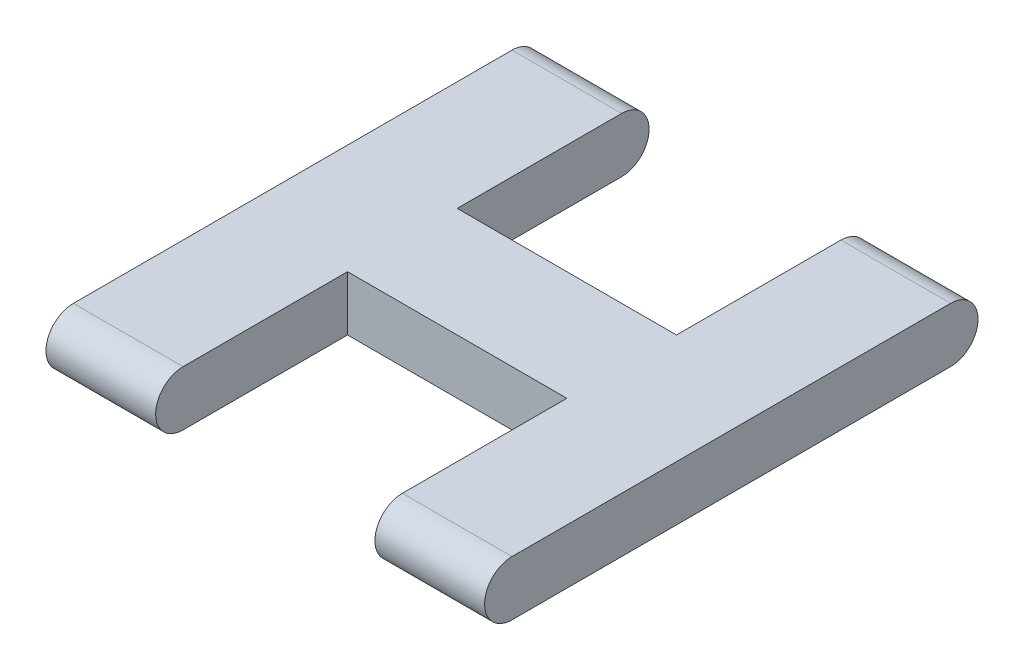
ISO-10303-21;
HEADER;
FILE_DESCRIPTION(('STEP AP214'),'2;1');
FILE_NAME('part.step','',(''),(''),'','','');
FILE_SCHEMA(('AUTOMOTIVE_DESIGN { 1 0 10303 214 1 1 1 1 }'));
ENDSEC;
DATA;
#1=APPLICATION_CONTEXT('core data for automotive mechanical design processes');
#2=APPLICATION_PROTOCOL_DEFINITION('international standard','automotive_design',2000,#1);
#3=PRODUCT_CONTEXT('',#1,'mechanical');
#4=PRODUCT('Part','Part','',(#3));
#5=PRODUCT_RELATED_PRODUCT_CATEGORY('part','',(#4));
#6=PRODUCT_DEFINITION_FORMATION('','',#4);
#7=PRODUCT_DEFINITION_CONTEXT('part definition',#1,'design');
#8=PRODUCT_DEFINITION('design','',#6,#7);
#9=PRODUCT_DEFINITION_SHAPE('','',#8);
#10=(LENGTH_UNIT() NAMED_UNIT(*) SI_UNIT(.MILLI.,.METRE.));
#11=(NAMED_UNIT(*) PLANE_ANGLE_UNIT() SI_UNIT($,.RADIAN.));
#12=(NAMED_UNIT(*) SI_UNIT($,.STERADIAN.) SOLID_ANGLE_UNIT());
#13=UNCERTAINTY_MEASURE_WITH_UNIT(LENGTH_MEASURE(1.E-05),#10,'distance_accuracy_value','');
#14=(GEOMETRIC_REPRESENTATION_CONTEXT(3) GLOBAL_UNCERTAINTY_ASSIGNED_CONTEXT((#13)) GLOBAL_UNIT_ASSIGNED_CONTEXT((#10,
#11,#12)) REPRESENTATION_CONTEXT('',''));
#15=CARTESIAN_POINT('',(0.,0.,0.));
#16=DIRECTION('',(0.,0.,1.));
#17=DIRECTION('',(1.,0.,0.));
#18=AXIS2_PLACEMENT_3D('',#15,#16,#17);
#19=CARTESIAN_POINT('',(16.,0.,8.));
#20=DIRECTION('',(-1.,0.,0.));
#21=DIRECTION('',(0.,0.,1.));
#22=AXIS2_PLACEMENT_3D('',#19,#20,#21);
#23=CYLINDRICAL_SURFACE('',#22,1.);
#24=DIRECTION('',(-1.,0.,0.));
#25=VECTOR('',#24,1.);
#26=CARTESIAN_POINT('',(16.,1.,8.));
#27=LINE('',#26,#25);
#28=CARTESIAN_POINT('',(16.,1.,8.));
#29=VERTEX_POINT('',#28);
#30=CARTESIAN_POINT('',(12.,1.,8.));
#31=VERTEX_POINT('',#30);
#32=EDGE_CURVE('E199',#29,#31,#27,.T.);
#33=ORIENTED_EDGE('',*,*,#32,.T.);
#34=CARTESIAN_POINT('',(12.,0.,8.));
#35=DIRECTION('',(1.,0.,0.));
#36=DIRECTION('',(0.,0.,-1.));
#37=AXIS2_PLACEMENT_3D('',#34,#35,#36);
#38=CIRCLE('',#37,1.);
#39=CARTESIAN_POINT('',(12.,-1.,8.));
#40=VERTEX_POINT('',#39);
#41=EDGE_CURVE('E163',#31,#40,#38,.T.);
#42=ORIENTED_EDGE('',*,*,#41,.T.);
#43=DIRECTION('',(-1.,0.,0.));
#44=VECTOR('',#43,1.);
#45=CARTESIAN_POINT('',(16.,-1.,8.));
#46=LINE('',#45,#44);
#47=CARTESIAN_POINT('',(16.,-1.,8.));
#48=VERTEX_POINT('',#47);
#49=EDGE_CURVE('E209',#48,#40,#46,.T.);
#50=ORIENTED_EDGE('',*,*,#49,.F.);
#51=CARTESIAN_POINT('',(16.,0.,8.));
#52=DIRECTION('',(1.,0.,0.));
#53=DIRECTION('',(0.,0.,-1.));
#54=AXIS2_PLACEMENT_3D('',#51,#52,#53);
#55=CIRCLE('',#54,1.);
#56=EDGE_CURVE('E178',#29,#48,#55,.T.);
#57=ORIENTED_EDGE('',*,*,#56,.F.);
#58=EDGE_LOOP('',(#33,#42,#50,#57));
#59=FACE_BOUND('',#58,.T.);
#60=ADVANCED_FACE('F32',(#59),#23,.T.);
#61=CARTESIAN_POINT('',(16.,0.,-8.));
#62=DIRECTION('',(-1.,0.,0.));
#63=DIRECTION('',(0.,0.,1.));
#64=AXIS2_PLACEMENT_3D('',#61,#62,#63);
#65=CYLINDRICAL_SURFACE('',#64,1.);
#66=DIRECTION('',(-1.,0.,0.));
#67=VECTOR('',#66,1.);
#68=CARTESIAN_POINT('',(16.,1.,-8.));
#69=LINE('',#68,#67);
#70=CARTESIAN_POINT('',(4.,1.,-8.));
#71=VERTEX_POINT('',#70);
#72=CARTESIAN_POINT('',(0.,1.,-8.));
#73=VERTEX_POINT('',#72);
#74=EDGE_CURVE('E202',#71,#73,#69,.T.);
#75=ORIENTED_EDGE('',*,*,#74,.F.);
#76=CARTESIAN_POINT('',(4.,0.,-8.));
#77=DIRECTION('',(-1.,0.,0.));
#78=DIRECTION('',(0.,0.,1.));
#79=AXIS2_PLACEMENT_3D('',#76,#77,#78);
#80=CIRCLE('',#79,1.);
#81=CARTESIAN_POINT('',(4.,-0.999999999999997,-8.));
#82=VERTEX_POINT('',#81);
#83=EDGE_CURVE('E171',#71,#82,#80,.T.);
#84=ORIENTED_EDGE('',*,*,#83,.T.);
#85=DIRECTION('',(-1.,0.,0.));
#86=VECTOR('',#85,1.);
#87=CARTESIAN_POINT('',(16.,-0.999999999999997,-8.));
#88=LINE('',#87,#86);
#89=CARTESIAN_POINT('',(0.,-0.999999999999997,-8.));
#90=VERTEX_POINT('',#89);
#91=EDGE_CURVE('E204',#82,#90,#88,.T.);
#92=ORIENTED_EDGE('',*,*,#91,.T.);
#93=CARTESIAN_POINT('',(0.,0.,-8.));
#94=DIRECTION('',(1.,0.,0.));
#95=DIRECTION('',(0.,0.,-1.));
#96=AXIS2_PLACEMENT_3D('',#93,#94,#95);
#97=CIRCLE('',#96,1.);
#98=EDGE_CURVE('E194',#90,#73,#97,.T.);
#99=ORIENTED_EDGE('',*,*,#98,.T.);
#100=EDGE_LOOP('',(#75,#84,#92,#99));
#101=FACE_BOUND('',#100,.T.);
#102=ADVANCED_FACE('F232',(#101),#65,.T.);
#103=CARTESIAN_POINT('',(4.,-1.,8.));
#104=VERTEX_POINT('',#103);
#105=CARTESIAN_POINT('',(0.,-1.,8.));
#106=VERTEX_POINT('',#105);
#107=EDGE_CURVE('E208',#104,#106,#46,.T.);
#108=ORIENTED_EDGE('',*,*,#107,.F.);
#109=CARTESIAN_POINT('',(4.,0.,8.));
#110=DIRECTION('',(-1.,0.,0.));
#111=DIRECTION('',(0.,0.,1.));
#112=AXIS2_PLACEMENT_3D('',#109,#110,#111);
#113=CIRCLE('',#112,1.);
#114=CARTESIAN_POINT('',(4.,1.,8.));
#115=VERTEX_POINT('',#114);
#116=EDGE_CURVE('E157',#104,#115,#113,.T.);
#117=ORIENTED_EDGE('',*,*,#116,.T.);
#118=CARTESIAN_POINT('',(0.,1.,8.));
#119=VERTEX_POINT('',#118);
#120=EDGE_CURVE('E188',#115,#119,#27,.T.);
#121=ORIENTED_EDGE('',*,*,#120,.T.);
#122=CARTESIAN_POINT('',(0.,0.,8.));
#123=DIRECTION('',(1.,0.,0.));
#124=DIRECTION('',(0.,0.,-1.));
#125=AXIS2_PLACEMENT_3D('',#122,#123,#124);
#126=CIRCLE('',#125,1.);
#127=EDGE_CURVE('E177',#119,#106,#126,.T.);
#128=ORIENTED_EDGE('',*,*,#127,.T.);
#129=EDGE_LOOP('',(#108,#117,#121,#128));
#130=FACE_BOUND('',#129,.T.);
#131=ADVANCED_FACE('F34',(#130),#23,.T.);
#132=CARTESIAN_POINT('',(16.,-1.,8.));
#133=DIRECTION('',(0.,1.,0.));
#134=DIRECTION('',(0.,0.,1.));
#135=AXIS2_PLACEMENT_3D('',#132,#133,#134);
#136=PLANE('',#135);
#137=ORIENTED_EDGE('',*,*,#91,.F.);
#138=DIRECTION('',(0.,0.,1.));
#139=VECTOR('',#138,1.);
#140=CARTESIAN_POINT('',(4.,-1.,8.));
#141=LINE('',#140,#139);
#142=CARTESIAN_POINT('',(4.,-0.999999999999997,-2.));
#143=VERTEX_POINT('',#142);
#144=EDGE_CURVE('E174',#82,#143,#141,.T.);
#145=ORIENTED_EDGE('',*,*,#144,.T.);
#146=DIRECTION('',(1.,0.,0.));
#147=VECTOR('',#146,1.);
#148=CARTESIAN_POINT('',(16.,-0.999999999999998,-2.));
#149=LINE('',#148,#147);
#150=CARTESIAN_POINT('',(12.,-0.999999999999997,-2.));
#151=VERTEX_POINT('',#150);
#152=EDGE_CURVE('E166',#143,#151,#149,.T.);
#153=ORIENTED_EDGE('',*,*,#152,.T.);
#154=DIRECTION('',(0.,0.,-1.));
#155=VECTOR('',#154,1.);
#156=CARTESIAN_POINT('',(12.,-1.,8.));
#157=LINE('',#156,#155);
#158=CARTESIAN_POINT('',(12.,-0.999999999999997,-8.));
#159=VERTEX_POINT('',#158);
#160=EDGE_CURVE('E128',#151,#159,#157,.T.);
#161=ORIENTED_EDGE('',*,*,#160,.T.);
#162=CARTESIAN_POINT('',(16.,-0.999999999999997,-8.));
#163=VERTEX_POINT('',#162);
#164=EDGE_CURVE('E205',#163,#159,#88,.T.);
#165=ORIENTED_EDGE('',*,*,#164,.F.);
#166=DIRECTION('',(0.,0.,-1.));
#167=VECTOR('',#166,1.);
#168=CARTESIAN_POINT('',(16.,-1.,8.));
#169=LINE('',#168,#167);
#170=EDGE_CURVE('E181',#48,#163,#169,.T.);
#171=ORIENTED_EDGE('',*,*,#170,.F.);
#172=ORIENTED_EDGE('',*,*,#49,.T.);
#173=DIRECTION('',(0.,0.,-1.));
#174=VECTOR('',#173,1.);
#175=CARTESIAN_POINT('',(12.,-1.,8.));
#176=LINE('',#175,#174);
#177=CARTESIAN_POINT('',(12.,-0.999999999999999,2.));
#178=VERTEX_POINT('',#177);
#179=EDGE_CURVE('E160',#40,#178,#176,.T.);
#180=ORIENTED_EDGE('',*,*,#179,.T.);
#181=DIRECTION('',(-1.,0.,0.));
#182=VECTOR('',#181,1.);
#183=CARTESIAN_POINT('',(16.,-0.999999999999999,2.));
#184=LINE('',#183,#182);
#185=CARTESIAN_POINT('',(4.,-0.999999999999999,2.));
#186=VERTEX_POINT('',#185);
#187=EDGE_CURVE('E130',#178,#186,#184,.T.);
#188=ORIENTED_EDGE('',*,*,#187,.T.);
#189=DIRECTION('',(0.,0.,1.));
#190=VECTOR('',#189,1.);
#191=CARTESIAN_POINT('',(4.,-1.,8.));
#192=LINE('',#191,#190);
#193=EDGE_CURVE('E154',#186,#104,#192,.T.);
#194=ORIENTED_EDGE('',*,*,#193,.T.);
#195=ORIENTED_EDGE('',*,*,#107,.T.);
#196=DIRECTION('',(0.,0.,-1.));
#197=VECTOR('',#196,1.);
#198=CARTESIAN_POINT('',(0.,-1.,8.));
#199=LINE('',#198,#197);
#200=EDGE_CURVE('E191',#106,#90,#199,.T.);
#201=ORIENTED_EDGE('',*,*,#200,.T.);
#202=EDGE_LOOP('',(#137,#145,#153,#161,#165,#171,#172,#180,#188,#194,#195,#201));
#203=FACE_BOUND('',#202,.T.);
#204=ADVANCED_FACE('F227',(#203),#136,.F.);
#205=ORIENTED_EDGE('',*,*,#164,.T.);
#206=CARTESIAN_POINT('',(12.,0.,-8.));
#207=DIRECTION('',(1.,0.,0.));
#208=DIRECTION('',(0.,0.,-1.));
#209=AXIS2_PLACEMENT_3D('',#206,#207,#208);
#210=CIRCLE('',#209,1.);
#211=CARTESIAN_POINT('',(12.,1.,-8.));
#212=VERTEX_POINT('',#211);
#213=EDGE_CURVE('E168',#159,#212,#210,.T.);
#214=ORIENTED_EDGE('',*,*,#213,.T.);
#215=CARTESIAN_POINT('',(16.,1.,-8.));
#216=VERTEX_POINT('',#215);
#217=EDGE_CURVE('E142',#216,#212,#69,.T.);
#218=ORIENTED_EDGE('',*,*,#217,.F.);
#219=CARTESIAN_POINT('',(16.,0.,-8.));
#220=DIRECTION('',(1.,0.,0.));
#221=DIRECTION('',(0.,0.,-1.));
#222=AXIS2_PLACEMENT_3D('',#219,#220,#221);
#223=CIRCLE('',#222,1.);
#224=EDGE_CURVE('E184',#163,#216,#223,.T.);
#225=ORIENTED_EDGE('',*,*,#224,.F.);
#226=EDGE_LOOP('',(#205,#214,#218,#225));
#227=FACE_BOUND('',#226,.T.);
#228=ADVANCED_FACE('F224',(#227),#65,.T.);
#229=CARTESIAN_POINT('',(16.,1.,8.));
#230=DIRECTION('',(0.,-1.,0.));
#231=DIRECTION('',(0.,0.,-1.));
#232=AXIS2_PLACEMENT_3D('',#229,#230,#231);
#233=PLANE('',#232);
#234=DIRECTION('',(1.,0.,0.));
#235=VECTOR('',#234,1.);
#236=CARTESIAN_POINT('',(4.,1.,-2.));
#237=LINE('',#236,#235);
#238=CARTESIAN_POINT('',(4.,1.,-2.));
#239=VERTEX_POINT('',#238);
#240=CARTESIAN_POINT('',(12.,1.,-2.));
#241=VERTEX_POINT('',#240);
#242=EDGE_CURVE('E133',#239,#241,#237,.T.);
#243=ORIENTED_EDGE('',*,*,#242,.F.);
#244=DIRECTION('',(0.,0.,-1.));
#245=VECTOR('',#244,1.);
#246=CARTESIAN_POINT('',(4.,1.,8.));
#247=LINE('',#246,#245);
#248=EDGE_CURVE('E11',#239,#71,#247,.T.);
#249=ORIENTED_EDGE('',*,*,#248,.T.);
#250=ORIENTED_EDGE('',*,*,#74,.T.);
#251=DIRECTION('',(0.,0.,1.));
#252=VECTOR('',#251,1.);
#253=CARTESIAN_POINT('',(0.,1.,8.));
#254=LINE('',#253,#252);
#255=EDGE_CURVE('E182',#73,#119,#254,.T.);
#256=ORIENTED_EDGE('',*,*,#255,.T.);
#257=ORIENTED_EDGE('',*,*,#120,.F.);
#258=DIRECTION('',(0.,0.,1.));
#259=VECTOR('',#258,1.);
#260=CARTESIAN_POINT('',(4.,0.999999999999999,11.6503397412012));
#261=LINE('',#260,#259);
#262=CARTESIAN_POINT('',(4.,1.,2.));
#263=VERTEX_POINT('',#262);
#264=EDGE_CURVE('E148',#263,#115,#261,.T.);
#265=ORIENTED_EDGE('',*,*,#264,.F.);
#266=DIRECTION('',(-1.,0.,0.));
#267=VECTOR('',#266,1.);
#268=CARTESIAN_POINT('',(12.,1.,2.));
#269=LINE('',#268,#267);
#270=CARTESIAN_POINT('',(12.,1.,2.));
#271=VERTEX_POINT('',#270);
#272=EDGE_CURVE('E146',#271,#263,#269,.T.);
#273=ORIENTED_EDGE('',*,*,#272,.F.);
#274=DIRECTION('',(0.,0.,1.));
#275=VECTOR('',#274,1.);
#276=CARTESIAN_POINT('',(12.,1.,8.));
#277=LINE('',#276,#275);
#278=EDGE_CURVE('E40',#271,#31,#277,.T.);
#279=ORIENTED_EDGE('',*,*,#278,.T.);
#280=ORIENTED_EDGE('',*,*,#32,.F.);
#281=DIRECTION('',(0.,0.,1.));
#282=VECTOR('',#281,1.);
#283=CARTESIAN_POINT('',(16.,1.,8.));
#284=LINE('',#283,#282);
#285=EDGE_CURVE('E186',#216,#29,#284,.T.);
#286=ORIENTED_EDGE('',*,*,#285,.F.);
#287=ORIENTED_EDGE('',*,*,#217,.T.);
#288=DIRECTION('',(0.,0.,-1.));
#289=VECTOR('',#288,1.);
#290=CARTESIAN_POINT('',(12.,1.,-11.7088191648484));
#291=LINE('',#290,#289);
#292=EDGE_CURVE('E125',#241,#212,#291,.T.);
#293=ORIENTED_EDGE('',*,*,#292,.F.);
#294=EDGE_LOOP('',(#243,#249,#250,#256,#257,#265,#273,#279,#280,#286,#287,#293));
#295=FACE_BOUND('',#294,.T.);
#296=ADVANCED_FACE('F139',(#295),#233,.F.);
#297=CARTESIAN_POINT('',(16.,0.,8.));
#298=DIRECTION('',(1.,0.,0.));
#299=DIRECTION('',(0.,0.,-1.));
#300=AXIS2_PLACEMENT_3D('',#297,#298,#299);
#301=PLANE('',#300);
#302=ORIENTED_EDGE('',*,*,#56,.T.);
#303=ORIENTED_EDGE('',*,*,#170,.T.);
#304=ORIENTED_EDGE('',*,*,#224,.T.);
#305=ORIENTED_EDGE('',*,*,#285,.T.);
#306=EDGE_LOOP('',(#302,#303,#304,#305));
#307=FACE_BOUND('',#306,.T.);
#308=ADVANCED_FACE('F220',(#307),#301,.T.);
#309=CARTESIAN_POINT('',(0.,0.,8.));
#310=DIRECTION('',(1.,0.,0.));
#311=DIRECTION('',(0.,0.,-1.));
#312=AXIS2_PLACEMENT_3D('',#309,#310,#311);
#313=PLANE('',#312);
#314=ORIENTED_EDGE('',*,*,#127,.F.);
#315=ORIENTED_EDGE('',*,*,#255,.F.);
#316=ORIENTED_EDGE('',*,*,#98,.F.);
#317=ORIENTED_EDGE('',*,*,#200,.F.);
#318=EDGE_LOOP('',(#314,#315,#316,#317));
#319=FACE_BOUND('',#318,.T.);
#320=ADVANCED_FACE('F238',(#319),#313,.F.);
#321=CARTESIAN_POINT('',(12.,-13.,11.6503397412012));
#322=DIRECTION('',(1.,0.,0.));
#323=DIRECTION('',(0.,0.,-1.));
#324=AXIS2_PLACEMENT_3D('',#321,#322,#323);
#325=PLANE('',#324);
#326=ORIENTED_EDGE('',*,*,#278,.F.);
#327=DIRECTION('',(0.,1.,0.));
#328=VECTOR('',#327,1.);
#329=CARTESIAN_POINT('',(12.,-13.,2.));
#330=LINE('',#329,#328);
#331=EDGE_CURVE('E55',#178,#271,#330,.T.);
#332=ORIENTED_EDGE('',*,*,#331,.F.);
#333=ORIENTED_EDGE('',*,*,#179,.F.);
#334=ORIENTED_EDGE('',*,*,#41,.F.);
#335=EDGE_LOOP('',(#326,#332,#333,#334));
#336=FACE_BOUND('',#335,.T.);
#337=ADVANCED_FACE('F246',(#336),#325,.F.);
#338=CARTESIAN_POINT('',(4.,-13.,11.6503397412012));
#339=DIRECTION('',(-1.,0.,0.));
#340=DIRECTION('',(0.,0.,1.));
#341=AXIS2_PLACEMENT_3D('',#338,#339,#340);
#342=PLANE('',#341);
#343=ORIENTED_EDGE('',*,*,#193,.F.);
#344=DIRECTION('',(0.,1.,0.));
#345=VECTOR('',#344,1.);
#346=CARTESIAN_POINT('',(4.,-13.,2.));
#347=LINE('',#346,#345);
#348=EDGE_CURVE('E136',#186,#263,#347,.T.);
#349=ORIENTED_EDGE('',*,*,#348,.T.);
#350=ORIENTED_EDGE('',*,*,#264,.T.);
#351=ORIENTED_EDGE('',*,*,#116,.F.);
#352=EDGE_LOOP('',(#343,#349,#350,#351));
#353=FACE_BOUND('',#352,.T.);
#354=ADVANCED_FACE('F243',(#353),#342,.F.);
#355=CARTESIAN_POINT('',(12.,-13.,2.));
#356=DIRECTION('',(0.,0.,-1.));
#357=DIRECTION('',(-1.,0.,0.));
#358=AXIS2_PLACEMENT_3D('',#355,#356,#357);
#359=PLANE('',#358);
#360=ORIENTED_EDGE('',*,*,#331,.T.);
#361=ORIENTED_EDGE('',*,*,#272,.T.);
#362=ORIENTED_EDGE('',*,*,#348,.F.);
#363=ORIENTED_EDGE('',*,*,#187,.F.);
#364=EDGE_LOOP('',(#360,#361,#362,#363));
#365=FACE_BOUND('',#364,.T.);
#366=ADVANCED_FACE('F245',(#365),#359,.F.);
#367=CARTESIAN_POINT('',(4.,-13.,-11.7088191648484));
#368=DIRECTION('',(-1.,0.,0.));
#369=DIRECTION('',(0.,0.,1.));
#370=AXIS2_PLACEMENT_3D('',#367,#368,#369);
#371=PLANE('',#370);
#372=ORIENTED_EDGE('',*,*,#83,.F.);
#373=ORIENTED_EDGE('',*,*,#248,.F.);
#374=DIRECTION('',(0.,1.,0.));
#375=VECTOR('',#374,1.);
#376=CARTESIAN_POINT('',(4.,-13.,-2.));
#377=LINE('',#376,#375);
#378=EDGE_CURVE('E47',#143,#239,#377,.T.);
#379=ORIENTED_EDGE('',*,*,#378,.F.);
#380=ORIENTED_EDGE('',*,*,#144,.F.);
#381=EDGE_LOOP('',(#372,#373,#379,#380));
#382=FACE_BOUND('',#381,.T.);
#383=ADVANCED_FACE('F229',(#382),#371,.F.);
#384=CARTESIAN_POINT('',(12.,-13.,-11.7088191648484));
#385=DIRECTION('',(1.,0.,0.));
#386=DIRECTION('',(0.,0.,-1.));
#387=AXIS2_PLACEMENT_3D('',#384,#385,#386);
#388=PLANE('',#387);
#389=DIRECTION('',(0.,1.,0.));
#390=VECTOR('',#389,1.);
#391=CARTESIAN_POINT('',(12.,-13.,-2.));
#392=LINE('',#391,#390);
#393=EDGE_CURVE('E122',#151,#241,#392,.T.);
#394=ORIENTED_EDGE('',*,*,#393,.T.);
#395=ORIENTED_EDGE('',*,*,#292,.T.);
#396=ORIENTED_EDGE('',*,*,#213,.F.);
#397=ORIENTED_EDGE('',*,*,#160,.F.);
#398=EDGE_LOOP('',(#394,#395,#396,#397));
#399=FACE_BOUND('',#398,.T.);
#400=ADVANCED_FACE('F123',(#399),#388,.F.);
#401=CARTESIAN_POINT('',(4.,-13.,-2.));
#402=DIRECTION('',(0.,0.,1.));
#403=DIRECTION('',(0.,-1.,0.));
#404=AXIS2_PLACEMENT_3D('',#401,#402,#403);
#405=PLANE('',#404);
#406=ORIENTED_EDGE('',*,*,#378,.T.);
#407=ORIENTED_EDGE('',*,*,#242,.T.);
#408=ORIENTED_EDGE('',*,*,#393,.F.);
#409=ORIENTED_EDGE('',*,*,#152,.F.);
#410=EDGE_LOOP('',(#406,#407,#408,#409));
#411=FACE_BOUND('',#410,.T.);
#412=ADVANCED_FACE('F134',(#411),#405,.F.);
#413=CLOSED_SHELL('',(#60,#102,#131,#204,#228,#296,#308,#320,#337,#354,#366,#383,#400,#412));
#414=MANIFOLD_SOLID_BREP('B2',#413);
#415=ADVANCED_BREP_SHAPE_REPRESENTATION('',(#18,#414),#14);
#416=SHAPE_DEFINITION_REPRESENTATION(#9,#415);
ENDSEC;
END-ISO-10303-21;
